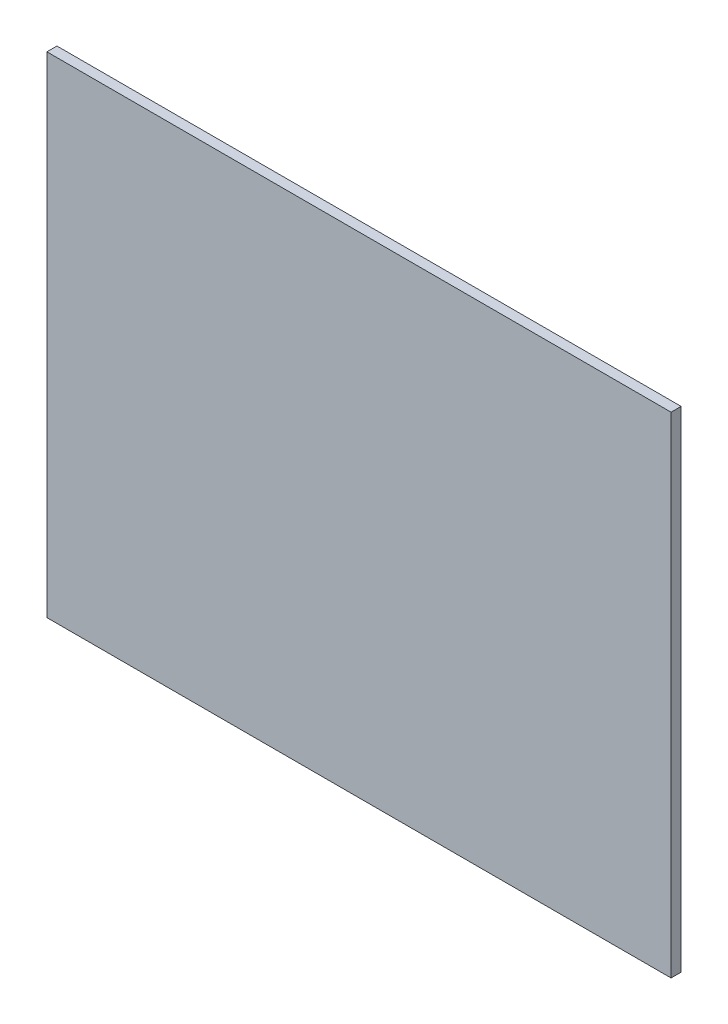
ISO-10303-21;
HEADER;
FILE_DESCRIPTION(('STEP AP214'),'2;1');
FILE_NAME('part.step','',(''),(''),'','','');
FILE_SCHEMA(('AUTOMOTIVE_DESIGN { 1 0 10303 214 1 1 1 1 }'));
ENDSEC;
DATA;
#1=APPLICATION_CONTEXT('core data for automotive mechanical design processes');
#2=APPLICATION_PROTOCOL_DEFINITION('international standard','automotive_design',2000,#1);
#3=PRODUCT_CONTEXT('',#1,'mechanical');
#4=PRODUCT('Part','Part','',(#3));
#5=PRODUCT_RELATED_PRODUCT_CATEGORY('part','',(#4));
#6=PRODUCT_DEFINITION_FORMATION('','',#4);
#7=PRODUCT_DEFINITION_CONTEXT('part definition',#1,'design');
#8=PRODUCT_DEFINITION('design','',#6,#7);
#9=PRODUCT_DEFINITION_SHAPE('','',#8);
#10=(LENGTH_UNIT() NAMED_UNIT(*) SI_UNIT(.MILLI.,.METRE.));
#11=(NAMED_UNIT(*) PLANE_ANGLE_UNIT() SI_UNIT($,.RADIAN.));
#12=(NAMED_UNIT(*) SI_UNIT($,.STERADIAN.) SOLID_ANGLE_UNIT());
#13=UNCERTAINTY_MEASURE_WITH_UNIT(LENGTH_MEASURE(1.E-05),#10,'distance_accuracy_value','');
#14=(GEOMETRIC_REPRESENTATION_CONTEXT(3) GLOBAL_UNCERTAINTY_ASSIGNED_CONTEXT((#13)) GLOBAL_UNIT_ASSIGNED_CONTEXT((#10,
#11,#12)) REPRESENTATION_CONTEXT('',''));
#15=CARTESIAN_POINT('',(0.,0.,0.));
#16=DIRECTION('',(0.,0.,1.));
#17=DIRECTION('',(1.,0.,0.));
#18=AXIS2_PLACEMENT_3D('',#15,#16,#17);
#19=CARTESIAN_POINT('',(0.,0.,2.5));
#20=DIRECTION('',(1.,0.,0.));
#21=DIRECTION('',(0.,0.,-1.));
#22=AXIS2_PLACEMENT_3D('',#19,#20,#21);
#23=PLANE('',#22);
#24=DIRECTION('',(0.,-1.,0.));
#25=VECTOR('',#24,1.);
#26=CARTESIAN_POINT('',(0.,0.,0.));
#27=LINE('',#26,#25);
#28=CARTESIAN_POINT('',(0.,122.,0.));
#29=VERTEX_POINT('',#28);
#30=CARTESIAN_POINT('',(0.,0.,0.));
#31=VERTEX_POINT('',#30);
#32=EDGE_CURVE('E109',#29,#31,#27,.T.);
#33=ORIENTED_EDGE('',*,*,#32,.T.);
#34=DIRECTION('',(0.,0.,-1.));
#35=VECTOR('',#34,1.);
#36=CARTESIAN_POINT('',(0.,0.,2.5));
#37=LINE('',#36,#35);
#38=CARTESIAN_POINT('',(0.,0.,2.5));
#39=VERTEX_POINT('',#38);
#40=EDGE_CURVE('E11',#39,#31,#37,.T.);
#41=ORIENTED_EDGE('',*,*,#40,.F.);
#42=DIRECTION('',(0.,-1.,0.));
#43=VECTOR('',#42,1.);
#44=CARTESIAN_POINT('',(0.,0.,2.5));
#45=LINE('',#44,#43);
#46=CARTESIAN_POINT('',(0.,122.,2.5));
#47=VERTEX_POINT('',#46);
#48=EDGE_CURVE('E93',#47,#39,#45,.T.);
#49=ORIENTED_EDGE('',*,*,#48,.F.);
#50=DIRECTION('',(0.,0.,-1.));
#51=VECTOR('',#50,1.);
#52=CARTESIAN_POINT('',(0.,122.,2.5));
#53=LINE('',#52,#51);
#54=EDGE_CURVE('E105',#47,#29,#53,.T.);
#55=ORIENTED_EDGE('',*,*,#54,.T.);
#56=EDGE_LOOP('',(#33,#41,#49,#55));
#57=FACE_BOUND('',#56,.T.);
#58=ADVANCED_FACE('F41',(#57),#23,.F.);
#59=CARTESIAN_POINT('',(0.,0.,2.5));
#60=DIRECTION('',(0.,1.,0.));
#61=DIRECTION('',(0.,0.,1.));
#62=AXIS2_PLACEMENT_3D('',#59,#60,#61);
#63=PLANE('',#62);
#64=DIRECTION('',(1.,0.,0.));
#65=VECTOR('',#64,1.);
#66=CARTESIAN_POINT('',(0.,0.,0.));
#67=LINE('',#66,#65);
#68=CARTESIAN_POINT('',(155.4,0.,0.));
#69=VERTEX_POINT('',#68);
#70=EDGE_CURVE('E98',#31,#69,#67,.T.);
#71=ORIENTED_EDGE('',*,*,#70,.T.);
#72=DIRECTION('',(0.,0.,-1.));
#73=VECTOR('',#72,1.);
#74=CARTESIAN_POINT('',(155.4,0.,2.5));
#75=LINE('',#74,#73);
#76=CARTESIAN_POINT('',(155.4,0.,2.5));
#77=VERTEX_POINT('',#76);
#78=EDGE_CURVE('E50',#77,#69,#75,.T.);
#79=ORIENTED_EDGE('',*,*,#78,.F.);
#80=DIRECTION('',(1.,0.,0.));
#81=VECTOR('',#80,1.);
#82=CARTESIAN_POINT('',(0.,0.,2.5));
#83=LINE('',#82,#81);
#84=EDGE_CURVE('E88',#39,#77,#83,.T.);
#85=ORIENTED_EDGE('',*,*,#84,.F.);
#86=ORIENTED_EDGE('',*,*,#40,.T.);
#87=EDGE_LOOP('',(#71,#79,#85,#86));
#88=FACE_BOUND('',#87,.T.);
#89=ADVANCED_FACE('F97',(#88),#63,.F.);
#90=CARTESIAN_POINT('',(155.4,0.,2.5));
#91=DIRECTION('',(-1.,0.,0.));
#92=DIRECTION('',(0.,0.,1.));
#93=AXIS2_PLACEMENT_3D('',#90,#91,#92);
#94=PLANE('',#93);
#95=DIRECTION('',(0.,1.,0.));
#96=VECTOR('',#95,1.);
#97=CARTESIAN_POINT('',(155.4,0.,0.));
#98=LINE('',#97,#96);
#99=CARTESIAN_POINT('',(155.4,122.,0.));
#100=VERTEX_POINT('',#99);
#101=EDGE_CURVE('E75',#69,#100,#98,.T.);
#102=ORIENTED_EDGE('',*,*,#101,.T.);
#103=DIRECTION('',(0.,0.,-1.));
#104=VECTOR('',#103,1.);
#105=CARTESIAN_POINT('',(155.4,122.,2.5));
#106=LINE('',#105,#104);
#107=CARTESIAN_POINT('',(155.4,122.,2.5));
#108=VERTEX_POINT('',#107);
#109=EDGE_CURVE('E100',#108,#100,#106,.T.);
#110=ORIENTED_EDGE('',*,*,#109,.F.);
#111=DIRECTION('',(0.,1.,0.));
#112=VECTOR('',#111,1.);
#113=CARTESIAN_POINT('',(155.4,0.,2.5));
#114=LINE('',#113,#112);
#115=EDGE_CURVE('E91',#77,#108,#114,.T.);
#116=ORIENTED_EDGE('',*,*,#115,.F.);
#117=ORIENTED_EDGE('',*,*,#78,.T.);
#118=EDGE_LOOP('',(#102,#110,#116,#117));
#119=FACE_BOUND('',#118,.T.);
#120=ADVANCED_FACE('F101',(#119),#94,.F.);
#121=CARTESIAN_POINT('',(0.,122.,2.5));
#122=DIRECTION('',(0.,-1.,0.));
#123=DIRECTION('',(0.,0.,-1.));
#124=AXIS2_PLACEMENT_3D('',#121,#122,#123);
#125=PLANE('',#124);
#126=DIRECTION('',(-1.,0.,0.));
#127=VECTOR('',#126,1.);
#128=CARTESIAN_POINT('',(0.,122.,0.));
#129=LINE('',#128,#127);
#130=EDGE_CURVE('E81',#100,#29,#129,.T.);
#131=ORIENTED_EDGE('',*,*,#130,.T.);
#132=ORIENTED_EDGE('',*,*,#54,.F.);
#133=DIRECTION('',(-1.,0.,0.));
#134=VECTOR('',#133,1.);
#135=CARTESIAN_POINT('',(0.,122.,2.5));
#136=LINE('',#135,#134);
#137=EDGE_CURVE('E58',#108,#47,#136,.T.);
#138=ORIENTED_EDGE('',*,*,#137,.F.);
#139=ORIENTED_EDGE('',*,*,#109,.T.);
#140=EDGE_LOOP('',(#131,#132,#138,#139));
#141=FACE_BOUND('',#140,.T.);
#142=ADVANCED_FACE('F122',(#141),#125,.F.);
#143=CARTESIAN_POINT('',(0.,0.,2.5));
#144=DIRECTION('',(0.,0.,-1.));
#145=DIRECTION('',(-1.,0.,0.));
#146=AXIS2_PLACEMENT_3D('',#143,#144,#145);
#147=PLANE('',#146);
#148=ORIENTED_EDGE('',*,*,#48,.T.);
#149=ORIENTED_EDGE('',*,*,#84,.T.);
#150=ORIENTED_EDGE('',*,*,#115,.T.);
#151=ORIENTED_EDGE('',*,*,#137,.T.);
#152=EDGE_LOOP('',(#148,#149,#150,#151));
#153=FACE_BOUND('',#152,.T.);
#154=ADVANCED_FACE('F89',(#153),#147,.F.);
#155=CARTESIAN_POINT('',(0.,0.,0.));
#156=DIRECTION('',(0.,0.,-1.));
#157=DIRECTION('',(-1.,0.,0.));
#158=AXIS2_PLACEMENT_3D('',#155,#156,#157);
#159=PLANE('',#158);
#160=ORIENTED_EDGE('',*,*,#32,.F.);
#161=ORIENTED_EDGE('',*,*,#130,.F.);
#162=ORIENTED_EDGE('',*,*,#101,.F.);
#163=ORIENTED_EDGE('',*,*,#70,.F.);
#164=EDGE_LOOP('',(#160,#161,#162,#163));
#165=FACE_BOUND('',#164,.T.);
#166=ADVANCED_FACE('F125',(#165),#159,.T.);
#167=CLOSED_SHELL('',(#58,#89,#120,#142,#154,#166));
#168=MANIFOLD_SOLID_BREP('B2',#167);
#169=ADVANCED_BREP_SHAPE_REPRESENTATION('',(#18,#168),#14);
#170=SHAPE_DEFINITION_REPRESENTATION(#9,#169);
ENDSEC;
END-ISO-10303-21;
